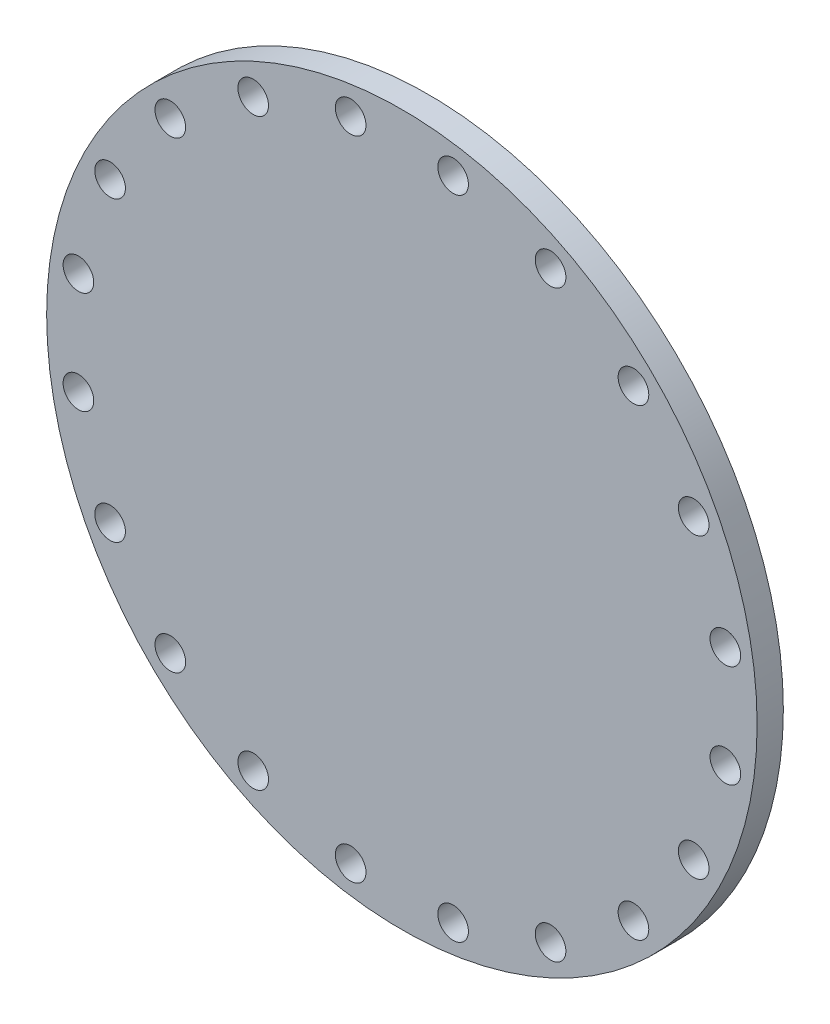
ISO-10303-21;
HEADER;
FILE_DESCRIPTION(('STEP AP214'),'2;1');
FILE_NAME('part.step','',(''),(''),'','','');
FILE_SCHEMA(('AUTOMOTIVE_DESIGN { 1 0 10303 214 1 1 1 1 }'));
ENDSEC;
DATA;
#1=APPLICATION_CONTEXT('core data for automotive mechanical design processes');
#2=APPLICATION_PROTOCOL_DEFINITION('international standard','automotive_design',2000,#1);
#3=PRODUCT_CONTEXT('',#1,'mechanical');
#4=PRODUCT('Part','Part','',(#3));
#5=PRODUCT_RELATED_PRODUCT_CATEGORY('part','',(#4));
#6=PRODUCT_DEFINITION_FORMATION('','',#4);
#7=PRODUCT_DEFINITION_CONTEXT('part definition',#1,'design');
#8=PRODUCT_DEFINITION('design','',#6,#7);
#9=PRODUCT_DEFINITION_SHAPE('','',#8);
#10=(LENGTH_UNIT() NAMED_UNIT(*) SI_UNIT(.MILLI.,.METRE.));
#11=(NAMED_UNIT(*) PLANE_ANGLE_UNIT() SI_UNIT($,.RADIAN.));
#12=(NAMED_UNIT(*) SI_UNIT($,.STERADIAN.) SOLID_ANGLE_UNIT());
#13=UNCERTAINTY_MEASURE_WITH_UNIT(LENGTH_MEASURE(1.E-05),#10,'distance_accuracy_value','');
#14=(GEOMETRIC_REPRESENTATION_CONTEXT(3) GLOBAL_UNCERTAINTY_ASSIGNED_CONTEXT((#13)) GLOBAL_UNIT_ASSIGNED_CONTEXT((#10,
#11,#12)) REPRESENTATION_CONTEXT('',''));
#15=CARTESIAN_POINT('',(0.,0.,0.));
#16=DIRECTION('',(0.,0.,1.));
#17=DIRECTION('',(1.,0.,0.));
#18=AXIS2_PLACEMENT_3D('',#15,#16,#17);
#19=CARTESIAN_POINT('',(0.,0.,30.));
#20=DIRECTION('',(0.,0.,-1.));
#21=DIRECTION('',(-1.,0.,0.));
#22=AXIS2_PLACEMENT_3D('',#19,#20,#21);
#23=CYLINDRICAL_SURFACE('',#22,406.4);
#24=CARTESIAN_POINT('',(0.,0.,30.));
#25=DIRECTION('',(0.,0.,1.));
#26=DIRECTION('',(1.,0.,0.));
#27=AXIS2_PLACEMENT_3D('',#24,#25,#26);
#28=CIRCLE('',#27,406.4);
#29=CARTESIAN_POINT('',(406.4,0.,30.));
#30=VERTEX_POINT('',#29);
#31=EDGE_CURVE('E10',#30,#30,#28,.T.);
#32=ORIENTED_EDGE('',*,*,#31,.F.);
#33=EDGE_LOOP('',(#32));
#34=FACE_BOUND('',#33,.T.);
#35=CARTESIAN_POINT('',(0.,0.,0.));
#36=DIRECTION('',(0.,0.,1.));
#37=DIRECTION('',(1.,0.,0.));
#38=AXIS2_PLACEMENT_3D('',#35,#36,#37);
#39=CIRCLE('',#38,406.4);
#40=CARTESIAN_POINT('',(406.4,0.,0.));
#41=VERTEX_POINT('',#40);
#42=EDGE_CURVE('E31',#41,#41,#39,.T.);
#43=ORIENTED_EDGE('',*,*,#42,.T.);
#44=EDGE_LOOP('',(#43));
#45=FACE_BOUND('',#44,.T.);
#46=ADVANCED_FACE('F28',(#34,#45),#23,.T.);
#47=CARTESIAN_POINT('',(0.,0.,30.));
#48=DIRECTION('',(0.,0.,1.));
#49=DIRECTION('',(1.,0.,0.));
#50=AXIS2_PLACEMENT_3D('',#47,#48,#49);
#51=PLANE('',#50);
#52=CARTESIAN_POINT('',(-170.087540727417,333.815594287174,30.));
#53=DIRECTION('',(0.,0.,-1.));
#54=DIRECTION('',(-0.951056516295158,-0.309016994374935,0.));
#55=AXIS2_PLACEMENT_3D('',#52,#53,#54);
#56=CIRCLE('',#55,17.526);
#57=CARTESIAN_POINT('',(-186.755757232006,328.399762443759,30.));
#58=VERTEX_POINT('',#57);
#59=EDGE_CURVE('E151',#58,#58,#56,.T.);
#60=ORIENTED_EDGE('',*,*,#59,.T.);
#61=EDGE_LOOP('',(#60));
#62=FACE_BOUND('',#61,.T.);
#63=CARTESIAN_POINT('',(-264.917555571537,264.917555571543,30.));
#64=DIRECTION('',(0.,0.,-1.));
#65=DIRECTION('',(-0.809016994374955,-0.587785252292462,0.));
#66=AXIS2_PLACEMENT_3D('',#63,#64,#65);
#67=CIRCLE('',#66,17.526);
#68=CARTESIAN_POINT('',(-279.096387414952,254.616031239866,30.));
#69=VERTEX_POINT('',#68);
#70=EDGE_CURVE('E145',#69,#69,#67,.T.);
#71=ORIENTED_EDGE('',*,*,#70,.T.);
#72=EDGE_LOOP('',(#71));
#73=FACE_BOUND('',#72,.T.);
#74=CARTESIAN_POINT('',(-333.81559428717,170.087540727425,30.));
#75=DIRECTION('',(0.,0.,-1.));
#76=DIRECTION('',(-0.587785252292483,-0.80901699437494,0.));
#77=AXIS2_PLACEMENT_3D('',#74,#75,#76);
#78=CIRCLE('',#77,17.526);
#79=CARTESIAN_POINT('',(-344.117118618848,155.90870888401,30.));
#80=VERTEX_POINT('',#79);
#81=EDGE_CURVE('E139',#80,#80,#78,.T.);
#82=ORIENTED_EDGE('',*,*,#81,.T.);
#83=EDGE_LOOP('',(#82));
#84=FACE_BOUND('',#83,.T.);
#85=CARTESIAN_POINT('',(-370.037436803968,58.6081723273265,30.));
#86=DIRECTION('',(0.,0.,-1.));
#87=DIRECTION('',(-0.309016994374958,-0.95105651629515,0.));
#88=AXIS2_PLACEMENT_3D('',#85,#86,#87);
#89=CIRCLE('',#88,17.526);
#90=CARTESIAN_POINT('',(-375.453268647383,41.9399558227377,30.));
#91=VERTEX_POINT('',#90);
#92=EDGE_CURVE('E133',#91,#91,#89,.T.);
#93=ORIENTED_EDGE('',*,*,#92,.T.);
#94=EDGE_LOOP('',(#93));
#95=FACE_BOUND('',#94,.T.);
#96=CARTESIAN_POINT('',(-370.037436803969,-58.6081723273188,30.));
#97=DIRECTION('',(0.,0.,-1.));
#98=DIRECTION('',(0.,-1.,0.));
#99=AXIS2_PLACEMENT_3D('',#96,#97,#98);
#100=CIRCLE('',#99,17.526);
#101=CARTESIAN_POINT('',(-370.037436803969,-76.1341723273188,30.));
#102=VERTEX_POINT('',#101);
#103=EDGE_CURVE('E127',#102,#102,#100,.T.);
#104=ORIENTED_EDGE('',*,*,#103,.T.);
#105=EDGE_LOOP('',(#104));
#106=FACE_BOUND('',#105,.T.);
#107=CARTESIAN_POINT('',(-333.815594287174,-170.087540727418,30.));
#108=DIRECTION('',(0.,0.,-1.));
#109=DIRECTION('',(0.309016994374938,-0.951056516295157,0.));
#110=AXIS2_PLACEMENT_3D('',#107,#108,#109);
#111=CIRCLE('',#110,17.526);
#112=CARTESIAN_POINT('',(-328.399762443758,-186.755757232007,30.));
#113=VERTEX_POINT('',#112);
#114=EDGE_CURVE('E121',#113,#113,#111,.T.);
#115=ORIENTED_EDGE('',*,*,#114,.T.);
#116=EDGE_LOOP('',(#115));
#117=FACE_BOUND('',#116,.T.);
#118=CARTESIAN_POINT('',(-264.917555571542,-264.917555571538,30.));
#119=DIRECTION('',(0.,0.,-1.));
#120=DIRECTION('',(0.587785252292465,-0.809016994374953,0.));
#121=AXIS2_PLACEMENT_3D('',#118,#119,#120);
#122=CIRCLE('',#121,17.526);
#123=CARTESIAN_POINT('',(-254.616031239865,-279.096387414953,30.));
#124=VERTEX_POINT('',#123);
#125=EDGE_CURVE('E115',#124,#124,#122,.T.);
#126=ORIENTED_EDGE('',*,*,#125,.T.);
#127=EDGE_LOOP('',(#126));
#128=FACE_BOUND('',#127,.T.);
#129=CARTESIAN_POINT('',(-170.087540727424,-333.815594287171,30.));
#130=DIRECTION('',(0.,0.,-1.));
#131=DIRECTION('',(0.809016994374942,-0.58778525229248,0.));
#132=AXIS2_PLACEMENT_3D('',#129,#130,#131);
#133=CIRCLE('',#132,17.526);
#134=CARTESIAN_POINT('',(-155.908708884009,-344.117118618849,30.));
#135=VERTEX_POINT('',#134);
#136=EDGE_CURVE('E109',#135,#135,#133,.T.);
#137=ORIENTED_EDGE('',*,*,#136,.T.);
#138=EDGE_LOOP('',(#137));
#139=FACE_BOUND('',#138,.T.);
#140=CARTESIAN_POINT('',(-58.6081723273252,-370.037436803968,30.));
#141=DIRECTION('',(0.,0.,-1.));
#142=DIRECTION('',(0.951056516295151,-0.309016994374955,0.));
#143=AXIS2_PLACEMENT_3D('',#140,#141,#142);
#144=CIRCLE('',#143,17.526);
#145=CARTESIAN_POINT('',(-41.9399558227364,-375.453268647383,30.));
#146=VERTEX_POINT('',#145);
#147=EDGE_CURVE('E103',#146,#146,#144,.T.);
#148=ORIENTED_EDGE('',*,*,#147,.T.);
#149=EDGE_LOOP('',(#148));
#150=FACE_BOUND('',#149,.T.);
#151=CARTESIAN_POINT('',(58.6081723273201,-370.037436803969,30.));
#152=DIRECTION('',(0.,0.,-1.));
#153=DIRECTION('',(1.,0.,0.));
#154=AXIS2_PLACEMENT_3D('',#151,#152,#153);
#155=CIRCLE('',#154,17.526);
#156=CARTESIAN_POINT('',(76.1341723273201,-370.037436803969,30.));
#157=VERTEX_POINT('',#156);
#158=EDGE_CURVE('E97',#157,#157,#155,.T.);
#159=ORIENTED_EDGE('',*,*,#158,.T.);
#160=EDGE_LOOP('',(#159));
#161=FACE_BOUND('',#160,.T.);
#162=CARTESIAN_POINT('',(170.087540727419,-333.815594287173,30.));
#163=DIRECTION('',(0.,0.,-1.));
#164=DIRECTION('',(0.951056516295156,0.309016994374941,0.));
#165=AXIS2_PLACEMENT_3D('',#162,#163,#164);
#166=CIRCLE('',#165,17.526);
#167=CARTESIAN_POINT('',(186.755757232008,-328.399762443758,30.));
#168=VERTEX_POINT('',#167);
#169=EDGE_CURVE('E91',#168,#168,#166,.T.);
#170=ORIENTED_EDGE('',*,*,#169,.T.);
#171=EDGE_LOOP('',(#170));
#172=FACE_BOUND('',#171,.T.);
#173=CARTESIAN_POINT('',(264.917555571539,-264.917555571541,30.));
#174=DIRECTION('',(0.,0.,-1.));
#175=DIRECTION('',(0.809016994374951,0.587785252292469,0.));
#176=AXIS2_PLACEMENT_3D('',#173,#174,#175);
#177=CIRCLE('',#176,17.526);
#178=CARTESIAN_POINT('',(279.096387414954,-254.616031239864,30.));
#179=VERTEX_POINT('',#178);
#180=EDGE_CURVE('E85',#179,#179,#177,.T.);
#181=ORIENTED_EDGE('',*,*,#180,.T.);
#182=EDGE_LOOP('',(#181));
#183=FACE_BOUND('',#182,.T.);
#184=CARTESIAN_POINT('',(333.815594287171,-170.087540727423,30.));
#185=DIRECTION('',(0.,0.,-1.));
#186=DIRECTION('',(0.587785252292477,0.809016994374945,0.));
#187=AXIS2_PLACEMENT_3D('',#184,#185,#186);
#188=CIRCLE('',#187,17.526);
#189=CARTESIAN_POINT('',(344.117118618849,-155.908708884007,30.));
#190=VERTEX_POINT('',#189);
#191=EDGE_CURVE('E79',#190,#190,#188,.T.);
#192=ORIENTED_EDGE('',*,*,#191,.T.);
#193=EDGE_LOOP('',(#192));
#194=FACE_BOUND('',#193,.T.);
#195=CARTESIAN_POINT('',(370.037436803968,-58.6081723273239,30.));
#196=DIRECTION('',(0.,0.,-1.));
#197=DIRECTION('',(0.309016994374952,0.951056516295152,0.));
#198=AXIS2_PLACEMENT_3D('',#195,#196,#197);
#199=CIRCLE('',#198,17.526);
#200=CARTESIAN_POINT('',(375.453268647384,-41.9399558227351,30.));
#201=VERTEX_POINT('',#200);
#202=EDGE_CURVE('E73',#201,#201,#199,.T.);
#203=ORIENTED_EDGE('',*,*,#202,.T.);
#204=EDGE_LOOP('',(#203));
#205=FACE_BOUND('',#204,.T.);
#206=CARTESIAN_POINT('',(370.037436803969,58.6081723273214,30.));
#207=DIRECTION('',(0.,0.,-1.));
#208=DIRECTION('',(0.,1.,0.));
#209=AXIS2_PLACEMENT_3D('',#206,#207,#208);
#210=CIRCLE('',#209,17.526);
#211=CARTESIAN_POINT('',(370.037436803969,76.1341723273214,30.));
#212=VERTEX_POINT('',#211);
#213=EDGE_CURVE('E67',#212,#212,#210,.T.);
#214=ORIENTED_EDGE('',*,*,#213,.T.);
#215=EDGE_LOOP('',(#214));
#216=FACE_BOUND('',#215,.T.);
#217=CARTESIAN_POINT('',(333.815594287173,170.087540727421,30.));
#218=DIRECTION('',(0.,0.,-1.));
#219=DIRECTION('',(-0.309016994374945,0.951056516295155,0.));
#220=AXIS2_PLACEMENT_3D('',#217,#218,#219);
#221=CIRCLE('',#220,17.526);
#222=CARTESIAN_POINT('',(328.399762443757,186.755757232009,30.));
#223=VERTEX_POINT('',#222);
#224=EDGE_CURVE('E61',#223,#223,#221,.T.);
#225=ORIENTED_EDGE('',*,*,#224,.T.);
#226=EDGE_LOOP('',(#225));
#227=FACE_BOUND('',#226,.T.);
#228=CARTESIAN_POINT('',(264.917555571541,264.91755557154,30.));
#229=DIRECTION('',(0.,0.,-1.));
#230=DIRECTION('',(-0.587785252292471,0.809016994374949,0.));
#231=AXIS2_PLACEMENT_3D('',#228,#229,#230);
#232=CIRCLE('',#231,17.526);
#233=CARTESIAN_POINT('',(254.616031239863,279.096387414955,30.));
#234=VERTEX_POINT('',#233);
#235=EDGE_CURVE('E55',#234,#234,#232,.T.);
#236=ORIENTED_EDGE('',*,*,#235,.T.);
#237=EDGE_LOOP('',(#236));
#238=FACE_BOUND('',#237,.T.);
#239=CARTESIAN_POINT('',(170.087540727422,333.815594287172,30.));
#240=DIRECTION('',(0.,0.,-1.));
#241=DIRECTION('',(-0.809016994374947,0.587785252292474,0.));
#242=AXIS2_PLACEMENT_3D('',#239,#240,#241);
#243=CIRCLE('',#242,17.526);
#244=CARTESIAN_POINT('',(155.908708884006,344.11711861885,30.));
#245=VERTEX_POINT('',#244);
#246=EDGE_CURVE('E49',#245,#245,#243,.T.);
#247=ORIENTED_EDGE('',*,*,#246,.T.);
#248=EDGE_LOOP('',(#247));
#249=FACE_BOUND('',#248,.T.);
#250=CARTESIAN_POINT('',(58.6081723273226,370.037436803968,30.));
#251=DIRECTION('',(0.,0.,-1.));
#252=DIRECTION('',(-0.951056516295154,0.309016994374948,0.));
#253=AXIS2_PLACEMENT_3D('',#250,#251,#252);
#254=CIRCLE('',#253,17.526);
#255=CARTESIAN_POINT('',(41.9399558227338,375.453268647384,30.));
#256=VERTEX_POINT('',#255);
#257=EDGE_CURVE('E43',#256,#256,#254,.T.);
#258=ORIENTED_EDGE('',*,*,#257,.T.);
#259=EDGE_LOOP('',(#258));
#260=FACE_BOUND('',#259,.T.);
#261=CARTESIAN_POINT('',(-58.6081723273227,370.037436803968,30.));
#262=DIRECTION('',(0.,0.,-1.));
#263=DIRECTION('',(-1.,0.,0.));
#264=AXIS2_PLACEMENT_3D('',#261,#262,#263);
#265=CIRCLE('',#264,17.526);
#266=CARTESIAN_POINT('',(-76.1341723273227,370.037436803968,30.));
#267=VERTEX_POINT('',#266);
#268=EDGE_CURVE('E38',#267,#267,#265,.T.);
#269=ORIENTED_EDGE('',*,*,#268,.T.);
#270=EDGE_LOOP('',(#269));
#271=FACE_BOUND('',#270,.T.);
#272=ORIENTED_EDGE('',*,*,#31,.T.);
#273=EDGE_LOOP('',(#272));
#274=FACE_BOUND('',#273,.T.);
#275=ADVANCED_FACE('F160',(#62,#73,#84,#95,#106,#117,#128,#139,#150,#161,#172,#183,#194,#205,
#216,#227,#238,#249,#260,#271,#274),#51,.T.);
#276=CARTESIAN_POINT('',(0.,0.,0.));
#277=DIRECTION('',(0.,0.,1.));
#278=DIRECTION('',(1.,0.,0.));
#279=AXIS2_PLACEMENT_3D('',#276,#277,#278);
#280=PLANE('',#279);
#281=CARTESIAN_POINT('',(-170.087540727417,333.815594287174,0.));
#282=DIRECTION('',(0.,0.,-1.));
#283=DIRECTION('',(-0.951056516295158,-0.309016994374935,0.));
#284=AXIS2_PLACEMENT_3D('',#281,#282,#283);
#285=CIRCLE('',#284,17.526);
#286=CARTESIAN_POINT('',(-186.755757232006,328.399762443759,0.));
#287=VERTEX_POINT('',#286);
#288=EDGE_CURVE('E154',#287,#287,#285,.T.);
#289=ORIENTED_EDGE('',*,*,#288,.F.);
#290=EDGE_LOOP('',(#289));
#291=FACE_BOUND('',#290,.T.);
#292=CARTESIAN_POINT('',(-264.917555571537,264.917555571543,0.));
#293=DIRECTION('',(0.,0.,-1.));
#294=DIRECTION('',(-0.809016994374955,-0.587785252292462,0.));
#295=AXIS2_PLACEMENT_3D('',#292,#293,#294);
#296=CIRCLE('',#295,17.526);
#297=CARTESIAN_POINT('',(-279.096387414952,254.616031239866,0.));
#298=VERTEX_POINT('',#297);
#299=EDGE_CURVE('E148',#298,#298,#296,.T.);
#300=ORIENTED_EDGE('',*,*,#299,.F.);
#301=EDGE_LOOP('',(#300));
#302=FACE_BOUND('',#301,.T.);
#303=CARTESIAN_POINT('',(-333.81559428717,170.087540727425,0.));
#304=DIRECTION('',(0.,0.,-1.));
#305=DIRECTION('',(-0.587785252292483,-0.80901699437494,0.));
#306=AXIS2_PLACEMENT_3D('',#303,#304,#305);
#307=CIRCLE('',#306,17.526);
#308=CARTESIAN_POINT('',(-344.117118618848,155.90870888401,0.));
#309=VERTEX_POINT('',#308);
#310=EDGE_CURVE('E142',#309,#309,#307,.T.);
#311=ORIENTED_EDGE('',*,*,#310,.F.);
#312=EDGE_LOOP('',(#311));
#313=FACE_BOUND('',#312,.T.);
#314=CARTESIAN_POINT('',(-370.037436803968,58.6081723273265,0.));
#315=DIRECTION('',(0.,0.,-1.));
#316=DIRECTION('',(-0.309016994374958,-0.95105651629515,0.));
#317=AXIS2_PLACEMENT_3D('',#314,#315,#316);
#318=CIRCLE('',#317,17.526);
#319=CARTESIAN_POINT('',(-375.453268647383,41.9399558227377,0.));
#320=VERTEX_POINT('',#319);
#321=EDGE_CURVE('E136',#320,#320,#318,.T.);
#322=ORIENTED_EDGE('',*,*,#321,.F.);
#323=EDGE_LOOP('',(#322));
#324=FACE_BOUND('',#323,.T.);
#325=CARTESIAN_POINT('',(-370.037436803969,-58.6081723273188,0.));
#326=DIRECTION('',(0.,0.,-1.));
#327=DIRECTION('',(0.,-1.,0.));
#328=AXIS2_PLACEMENT_3D('',#325,#326,#327);
#329=CIRCLE('',#328,17.526);
#330=CARTESIAN_POINT('',(-370.037436803969,-76.1341723273188,0.));
#331=VERTEX_POINT('',#330);
#332=EDGE_CURVE('E130',#331,#331,#329,.T.);
#333=ORIENTED_EDGE('',*,*,#332,.F.);
#334=EDGE_LOOP('',(#333));
#335=FACE_BOUND('',#334,.T.);
#336=CARTESIAN_POINT('',(-333.815594287174,-170.087540727418,0.));
#337=DIRECTION('',(0.,0.,-1.));
#338=DIRECTION('',(0.309016994374938,-0.951056516295157,0.));
#339=AXIS2_PLACEMENT_3D('',#336,#337,#338);
#340=CIRCLE('',#339,17.526);
#341=CARTESIAN_POINT('',(-328.399762443758,-186.755757232007,0.));
#342=VERTEX_POINT('',#341);
#343=EDGE_CURVE('E124',#342,#342,#340,.T.);
#344=ORIENTED_EDGE('',*,*,#343,.F.);
#345=EDGE_LOOP('',(#344));
#346=FACE_BOUND('',#345,.T.);
#347=CARTESIAN_POINT('',(-264.917555571542,-264.917555571538,0.));
#348=DIRECTION('',(0.,0.,-1.));
#349=DIRECTION('',(0.587785252292465,-0.809016994374953,0.));
#350=AXIS2_PLACEMENT_3D('',#347,#348,#349);
#351=CIRCLE('',#350,17.526);
#352=CARTESIAN_POINT('',(-254.616031239865,-279.096387414953,0.));
#353=VERTEX_POINT('',#352);
#354=EDGE_CURVE('E118',#353,#353,#351,.T.);
#355=ORIENTED_EDGE('',*,*,#354,.F.);
#356=EDGE_LOOP('',(#355));
#357=FACE_BOUND('',#356,.T.);
#358=CARTESIAN_POINT('',(-170.087540727424,-333.815594287171,0.));
#359=DIRECTION('',(0.,0.,-1.));
#360=DIRECTION('',(0.809016994374942,-0.58778525229248,0.));
#361=AXIS2_PLACEMENT_3D('',#358,#359,#360);
#362=CIRCLE('',#361,17.526);
#363=CARTESIAN_POINT('',(-155.908708884009,-344.117118618849,0.));
#364=VERTEX_POINT('',#363);
#365=EDGE_CURVE('E112',#364,#364,#362,.T.);
#366=ORIENTED_EDGE('',*,*,#365,.F.);
#367=EDGE_LOOP('',(#366));
#368=FACE_BOUND('',#367,.T.);
#369=CARTESIAN_POINT('',(-58.6081723273252,-370.037436803968,0.));
#370=DIRECTION('',(0.,0.,-1.));
#371=DIRECTION('',(0.951056516295151,-0.309016994374955,0.));
#372=AXIS2_PLACEMENT_3D('',#369,#370,#371);
#373=CIRCLE('',#372,17.526);
#374=CARTESIAN_POINT('',(-41.9399558227364,-375.453268647383,0.));
#375=VERTEX_POINT('',#374);
#376=EDGE_CURVE('E106',#375,#375,#373,.T.);
#377=ORIENTED_EDGE('',*,*,#376,.F.);
#378=EDGE_LOOP('',(#377));
#379=FACE_BOUND('',#378,.T.);
#380=CARTESIAN_POINT('',(58.6081723273201,-370.037436803969,0.));
#381=DIRECTION('',(0.,0.,-1.));
#382=DIRECTION('',(1.,0.,0.));
#383=AXIS2_PLACEMENT_3D('',#380,#381,#382);
#384=CIRCLE('',#383,17.526);
#385=CARTESIAN_POINT('',(76.1341723273201,-370.037436803969,0.));
#386=VERTEX_POINT('',#385);
#387=EDGE_CURVE('E100',#386,#386,#384,.T.);
#388=ORIENTED_EDGE('',*,*,#387,.F.);
#389=EDGE_LOOP('',(#388));
#390=FACE_BOUND('',#389,.T.);
#391=CARTESIAN_POINT('',(170.087540727419,-333.815594287173,0.));
#392=DIRECTION('',(0.,0.,-1.));
#393=DIRECTION('',(0.951056516295156,0.309016994374941,0.));
#394=AXIS2_PLACEMENT_3D('',#391,#392,#393);
#395=CIRCLE('',#394,17.526);
#396=CARTESIAN_POINT('',(186.755757232008,-328.399762443758,0.));
#397=VERTEX_POINT('',#396);
#398=EDGE_CURVE('E94',#397,#397,#395,.T.);
#399=ORIENTED_EDGE('',*,*,#398,.F.);
#400=EDGE_LOOP('',(#399));
#401=FACE_BOUND('',#400,.T.);
#402=CARTESIAN_POINT('',(264.917555571539,-264.917555571541,0.));
#403=DIRECTION('',(0.,0.,-1.));
#404=DIRECTION('',(0.809016994374951,0.587785252292469,0.));
#405=AXIS2_PLACEMENT_3D('',#402,#403,#404);
#406=CIRCLE('',#405,17.526);
#407=CARTESIAN_POINT('',(279.096387414954,-254.616031239864,0.));
#408=VERTEX_POINT('',#407);
#409=EDGE_CURVE('E88',#408,#408,#406,.T.);
#410=ORIENTED_EDGE('',*,*,#409,.F.);
#411=EDGE_LOOP('',(#410));
#412=FACE_BOUND('',#411,.T.);
#413=CARTESIAN_POINT('',(333.815594287171,-170.087540727423,0.));
#414=DIRECTION('',(0.,0.,-1.));
#415=DIRECTION('',(0.587785252292477,0.809016994374945,0.));
#416=AXIS2_PLACEMENT_3D('',#413,#414,#415);
#417=CIRCLE('',#416,17.526);
#418=CARTESIAN_POINT('',(344.117118618849,-155.908708884007,0.));
#419=VERTEX_POINT('',#418);
#420=EDGE_CURVE('E82',#419,#419,#417,.T.);
#421=ORIENTED_EDGE('',*,*,#420,.F.);
#422=EDGE_LOOP('',(#421));
#423=FACE_BOUND('',#422,.T.);
#424=CARTESIAN_POINT('',(370.037436803968,-58.6081723273239,0.));
#425=DIRECTION('',(0.,0.,-1.));
#426=DIRECTION('',(0.309016994374952,0.951056516295152,0.));
#427=AXIS2_PLACEMENT_3D('',#424,#425,#426);
#428=CIRCLE('',#427,17.526);
#429=CARTESIAN_POINT('',(375.453268647384,-41.9399558227351,0.));
#430=VERTEX_POINT('',#429);
#431=EDGE_CURVE('E76',#430,#430,#428,.T.);
#432=ORIENTED_EDGE('',*,*,#431,.F.);
#433=EDGE_LOOP('',(#432));
#434=FACE_BOUND('',#433,.T.);
#435=CARTESIAN_POINT('',(370.037436803969,58.6081723273214,0.));
#436=DIRECTION('',(0.,0.,-1.));
#437=DIRECTION('',(0.,1.,0.));
#438=AXIS2_PLACEMENT_3D('',#435,#436,#437);
#439=CIRCLE('',#438,17.526);
#440=CARTESIAN_POINT('',(370.037436803969,76.1341723273214,0.));
#441=VERTEX_POINT('',#440);
#442=EDGE_CURVE('E70',#441,#441,#439,.T.);
#443=ORIENTED_EDGE('',*,*,#442,.F.);
#444=EDGE_LOOP('',(#443));
#445=FACE_BOUND('',#444,.T.);
#446=CARTESIAN_POINT('',(333.815594287173,170.087540727421,0.));
#447=DIRECTION('',(0.,0.,-1.));
#448=DIRECTION('',(-0.309016994374945,0.951056516295155,0.));
#449=AXIS2_PLACEMENT_3D('',#446,#447,#448);
#450=CIRCLE('',#449,17.526);
#451=CARTESIAN_POINT('',(328.399762443757,186.755757232009,0.));
#452=VERTEX_POINT('',#451);
#453=EDGE_CURVE('E64',#452,#452,#450,.T.);
#454=ORIENTED_EDGE('',*,*,#453,.F.);
#455=EDGE_LOOP('',(#454));
#456=FACE_BOUND('',#455,.T.);
#457=CARTESIAN_POINT('',(264.917555571541,264.91755557154,0.));
#458=DIRECTION('',(0.,0.,-1.));
#459=DIRECTION('',(-0.587785252292471,0.809016994374949,0.));
#460=AXIS2_PLACEMENT_3D('',#457,#458,#459);
#461=CIRCLE('',#460,17.526);
#462=CARTESIAN_POINT('',(254.616031239863,279.096387414955,0.));
#463=VERTEX_POINT('',#462);
#464=EDGE_CURVE('E58',#463,#463,#461,.T.);
#465=ORIENTED_EDGE('',*,*,#464,.F.);
#466=EDGE_LOOP('',(#465));
#467=FACE_BOUND('',#466,.T.);
#468=CARTESIAN_POINT('',(170.087540727422,333.815594287172,0.));
#469=DIRECTION('',(0.,0.,-1.));
#470=DIRECTION('',(-0.809016994374947,0.587785252292474,0.));
#471=AXIS2_PLACEMENT_3D('',#468,#469,#470);
#472=CIRCLE('',#471,17.526);
#473=CARTESIAN_POINT('',(155.908708884006,344.11711861885,0.));
#474=VERTEX_POINT('',#473);
#475=EDGE_CURVE('E52',#474,#474,#472,.T.);
#476=ORIENTED_EDGE('',*,*,#475,.F.);
#477=EDGE_LOOP('',(#476));
#478=FACE_BOUND('',#477,.T.);
#479=CARTESIAN_POINT('',(58.6081723273226,370.037436803968,0.));
#480=DIRECTION('',(0.,0.,-1.));
#481=DIRECTION('',(-0.951056516295154,0.309016994374948,0.));
#482=AXIS2_PLACEMENT_3D('',#479,#480,#481);
#483=CIRCLE('',#482,17.526);
#484=CARTESIAN_POINT('',(41.9399558227338,375.453268647384,0.));
#485=VERTEX_POINT('',#484);
#486=EDGE_CURVE('E46',#485,#485,#483,.T.);
#487=ORIENTED_EDGE('',*,*,#486,.F.);
#488=EDGE_LOOP('',(#487));
#489=FACE_BOUND('',#488,.T.);
#490=CARTESIAN_POINT('',(-58.6081723273227,370.037436803968,0.));
#491=DIRECTION('',(0.,0.,-1.));
#492=DIRECTION('',(-1.,0.,0.));
#493=AXIS2_PLACEMENT_3D('',#490,#491,#492);
#494=CIRCLE('',#493,17.526);
#495=CARTESIAN_POINT('',(-76.1341723273227,370.037436803968,0.));
#496=VERTEX_POINT('',#495);
#497=EDGE_CURVE('E40',#496,#496,#494,.T.);
#498=ORIENTED_EDGE('',*,*,#497,.F.);
#499=EDGE_LOOP('',(#498));
#500=FACE_BOUND('',#499,.T.);
#501=ORIENTED_EDGE('',*,*,#42,.F.);
#502=EDGE_LOOP('',(#501));
#503=FACE_BOUND('',#502,.T.);
#504=ADVANCED_FACE('F170',(#291,#302,#313,#324,#335,#346,#357,#368,#379,#390,#401,#412,#423,
#434,#445,#456,#467,#478,#489,#500,#503),#280,.F.);
#505=CARTESIAN_POINT('',(-58.6081723273227,370.037436803968,30.));
#506=DIRECTION('',(0.,0.,-1.));
#507=DIRECTION('',(-1.,0.,0.));
#508=AXIS2_PLACEMENT_3D('',#505,#506,#507);
#509=CYLINDRICAL_SURFACE('',#508,17.526);
#510=ORIENTED_EDGE('',*,*,#268,.F.);
#511=EDGE_LOOP('',(#510));
#512=FACE_BOUND('',#511,.T.);
#513=ORIENTED_EDGE('',*,*,#497,.T.);
#514=EDGE_LOOP('',(#513));
#515=FACE_BOUND('',#514,.T.);
#516=ADVANCED_FACE('F173',(#512,#515),#509,.F.);
#517=CARTESIAN_POINT('',(58.6081723273226,370.037436803968,30.));
#518=DIRECTION('',(0.,0.,-1.));
#519=DIRECTION('',(-1.,0.,0.));
#520=AXIS2_PLACEMENT_3D('',#517,#518,#519);
#521=CYLINDRICAL_SURFACE('',#520,17.526);
#522=ORIENTED_EDGE('',*,*,#257,.F.);
#523=EDGE_LOOP('',(#522));
#524=FACE_BOUND('',#523,.T.);
#525=ORIENTED_EDGE('',*,*,#486,.T.);
#526=EDGE_LOOP('',(#525));
#527=FACE_BOUND('',#526,.T.);
#528=ADVANCED_FACE('F225',(#524,#527),#521,.F.);
#529=CARTESIAN_POINT('',(170.087540727422,333.815594287172,30.));
#530=DIRECTION('',(0.,0.,-1.));
#531=DIRECTION('',(-1.,0.,0.));
#532=AXIS2_PLACEMENT_3D('',#529,#530,#531);
#533=CYLINDRICAL_SURFACE('',#532,17.526);
#534=ORIENTED_EDGE('',*,*,#246,.F.);
#535=EDGE_LOOP('',(#534));
#536=FACE_BOUND('',#535,.T.);
#537=ORIENTED_EDGE('',*,*,#475,.T.);
#538=EDGE_LOOP('',(#537));
#539=FACE_BOUND('',#538,.T.);
#540=ADVANCED_FACE('F229',(#536,#539),#533,.F.);
#541=CARTESIAN_POINT('',(264.917555571541,264.91755557154,30.));
#542=DIRECTION('',(0.,0.,-1.));
#543=DIRECTION('',(-1.,0.,0.));
#544=AXIS2_PLACEMENT_3D('',#541,#542,#543);
#545=CYLINDRICAL_SURFACE('',#544,17.526);
#546=ORIENTED_EDGE('',*,*,#235,.F.);
#547=EDGE_LOOP('',(#546));
#548=FACE_BOUND('',#547,.T.);
#549=ORIENTED_EDGE('',*,*,#464,.T.);
#550=EDGE_LOOP('',(#549));
#551=FACE_BOUND('',#550,.T.);
#552=ADVANCED_FACE('F233',(#548,#551),#545,.F.);
#553=CARTESIAN_POINT('',(333.815594287173,170.087540727421,30.));
#554=DIRECTION('',(0.,0.,-1.));
#555=DIRECTION('',(-1.,0.,0.));
#556=AXIS2_PLACEMENT_3D('',#553,#554,#555);
#557=CYLINDRICAL_SURFACE('',#556,17.526);
#558=ORIENTED_EDGE('',*,*,#224,.F.);
#559=EDGE_LOOP('',(#558));
#560=FACE_BOUND('',#559,.T.);
#561=ORIENTED_EDGE('',*,*,#453,.T.);
#562=EDGE_LOOP('',(#561));
#563=FACE_BOUND('',#562,.T.);
#564=ADVANCED_FACE('F237',(#560,#563),#557,.F.);
#565=CARTESIAN_POINT('',(370.037436803969,58.6081723273214,30.));
#566=DIRECTION('',(0.,0.,-1.));
#567=DIRECTION('',(-1.,0.,0.));
#568=AXIS2_PLACEMENT_3D('',#565,#566,#567);
#569=CYLINDRICAL_SURFACE('',#568,17.526);
#570=ORIENTED_EDGE('',*,*,#213,.F.);
#571=EDGE_LOOP('',(#570));
#572=FACE_BOUND('',#571,.T.);
#573=ORIENTED_EDGE('',*,*,#442,.T.);
#574=EDGE_LOOP('',(#573));
#575=FACE_BOUND('',#574,.T.);
#576=ADVANCED_FACE('F241',(#572,#575),#569,.F.);
#577=CARTESIAN_POINT('',(370.037436803968,-58.6081723273239,30.));
#578=DIRECTION('',(0.,0.,-1.));
#579=DIRECTION('',(-1.,0.,0.));
#580=AXIS2_PLACEMENT_3D('',#577,#578,#579);
#581=CYLINDRICAL_SURFACE('',#580,17.526);
#582=ORIENTED_EDGE('',*,*,#202,.F.);
#583=EDGE_LOOP('',(#582));
#584=FACE_BOUND('',#583,.T.);
#585=ORIENTED_EDGE('',*,*,#431,.T.);
#586=EDGE_LOOP('',(#585));
#587=FACE_BOUND('',#586,.T.);
#588=ADVANCED_FACE('F245',(#584,#587),#581,.F.);
#589=CARTESIAN_POINT('',(333.815594287171,-170.087540727423,30.));
#590=DIRECTION('',(0.,0.,-1.));
#591=DIRECTION('',(-1.,0.,0.));
#592=AXIS2_PLACEMENT_3D('',#589,#590,#591);
#593=CYLINDRICAL_SURFACE('',#592,17.526);
#594=ORIENTED_EDGE('',*,*,#191,.F.);
#595=EDGE_LOOP('',(#594));
#596=FACE_BOUND('',#595,.T.);
#597=ORIENTED_EDGE('',*,*,#420,.T.);
#598=EDGE_LOOP('',(#597));
#599=FACE_BOUND('',#598,.T.);
#600=ADVANCED_FACE('F249',(#596,#599),#593,.F.);
#601=CARTESIAN_POINT('',(264.917555571539,-264.917555571541,30.));
#602=DIRECTION('',(0.,0.,-1.));
#603=DIRECTION('',(-1.,0.,0.));
#604=AXIS2_PLACEMENT_3D('',#601,#602,#603);
#605=CYLINDRICAL_SURFACE('',#604,17.526);
#606=ORIENTED_EDGE('',*,*,#180,.F.);
#607=EDGE_LOOP('',(#606));
#608=FACE_BOUND('',#607,.T.);
#609=ORIENTED_EDGE('',*,*,#409,.T.);
#610=EDGE_LOOP('',(#609));
#611=FACE_BOUND('',#610,.T.);
#612=ADVANCED_FACE('F253',(#608,#611),#605,.F.);
#613=CARTESIAN_POINT('',(170.087540727419,-333.815594287173,30.));
#614=DIRECTION('',(0.,0.,-1.));
#615=DIRECTION('',(-1.,0.,0.));
#616=AXIS2_PLACEMENT_3D('',#613,#614,#615);
#617=CYLINDRICAL_SURFACE('',#616,17.526);
#618=ORIENTED_EDGE('',*,*,#169,.F.);
#619=EDGE_LOOP('',(#618));
#620=FACE_BOUND('',#619,.T.);
#621=ORIENTED_EDGE('',*,*,#398,.T.);
#622=EDGE_LOOP('',(#621));
#623=FACE_BOUND('',#622,.T.);
#624=ADVANCED_FACE('F257',(#620,#623),#617,.F.);
#625=CARTESIAN_POINT('',(58.6081723273201,-370.037436803969,30.));
#626=DIRECTION('',(0.,0.,-1.));
#627=DIRECTION('',(-1.,0.,0.));
#628=AXIS2_PLACEMENT_3D('',#625,#626,#627);
#629=CYLINDRICAL_SURFACE('',#628,17.526);
#630=ORIENTED_EDGE('',*,*,#158,.F.);
#631=EDGE_LOOP('',(#630));
#632=FACE_BOUND('',#631,.T.);
#633=ORIENTED_EDGE('',*,*,#387,.T.);
#634=EDGE_LOOP('',(#633));
#635=FACE_BOUND('',#634,.T.);
#636=ADVANCED_FACE('F261',(#632,#635),#629,.F.);
#637=CARTESIAN_POINT('',(-58.6081723273252,-370.037436803968,30.));
#638=DIRECTION('',(0.,0.,-1.));
#639=DIRECTION('',(-1.,0.,0.));
#640=AXIS2_PLACEMENT_3D('',#637,#638,#639);
#641=CYLINDRICAL_SURFACE('',#640,17.526);
#642=ORIENTED_EDGE('',*,*,#147,.F.);
#643=EDGE_LOOP('',(#642));
#644=FACE_BOUND('',#643,.T.);
#645=ORIENTED_EDGE('',*,*,#376,.T.);
#646=EDGE_LOOP('',(#645));
#647=FACE_BOUND('',#646,.T.);
#648=ADVANCED_FACE('F265',(#644,#647),#641,.F.);
#649=CARTESIAN_POINT('',(-170.087540727424,-333.815594287171,30.));
#650=DIRECTION('',(0.,0.,-1.));
#651=DIRECTION('',(-1.,0.,0.));
#652=AXIS2_PLACEMENT_3D('',#649,#650,#651);
#653=CYLINDRICAL_SURFACE('',#652,17.526);
#654=ORIENTED_EDGE('',*,*,#136,.F.);
#655=EDGE_LOOP('',(#654));
#656=FACE_BOUND('',#655,.T.);
#657=ORIENTED_EDGE('',*,*,#365,.T.);
#658=EDGE_LOOP('',(#657));
#659=FACE_BOUND('',#658,.T.);
#660=ADVANCED_FACE('F269',(#656,#659),#653,.F.);
#661=CARTESIAN_POINT('',(-264.917555571542,-264.917555571538,30.));
#662=DIRECTION('',(0.,0.,-1.));
#663=DIRECTION('',(-1.,0.,0.));
#664=AXIS2_PLACEMENT_3D('',#661,#662,#663);
#665=CYLINDRICAL_SURFACE('',#664,17.526);
#666=ORIENTED_EDGE('',*,*,#125,.F.);
#667=EDGE_LOOP('',(#666));
#668=FACE_BOUND('',#667,.T.);
#669=ORIENTED_EDGE('',*,*,#354,.T.);
#670=EDGE_LOOP('',(#669));
#671=FACE_BOUND('',#670,.T.);
#672=ADVANCED_FACE('F273',(#668,#671),#665,.F.);
#673=CARTESIAN_POINT('',(-333.815594287174,-170.087540727418,30.));
#674=DIRECTION('',(0.,0.,-1.));
#675=DIRECTION('',(-1.,0.,0.));
#676=AXIS2_PLACEMENT_3D('',#673,#674,#675);
#677=CYLINDRICAL_SURFACE('',#676,17.526);
#678=ORIENTED_EDGE('',*,*,#114,.F.);
#679=EDGE_LOOP('',(#678));
#680=FACE_BOUND('',#679,.T.);
#681=ORIENTED_EDGE('',*,*,#343,.T.);
#682=EDGE_LOOP('',(#681));
#683=FACE_BOUND('',#682,.T.);
#684=ADVANCED_FACE('F277',(#680,#683),#677,.F.);
#685=CARTESIAN_POINT('',(-370.037436803969,-58.6081723273188,30.));
#686=DIRECTION('',(0.,0.,-1.));
#687=DIRECTION('',(-1.,0.,0.));
#688=AXIS2_PLACEMENT_3D('',#685,#686,#687);
#689=CYLINDRICAL_SURFACE('',#688,17.526);
#690=ORIENTED_EDGE('',*,*,#103,.F.);
#691=EDGE_LOOP('',(#690));
#692=FACE_BOUND('',#691,.T.);
#693=ORIENTED_EDGE('',*,*,#332,.T.);
#694=EDGE_LOOP('',(#693));
#695=FACE_BOUND('',#694,.T.);
#696=ADVANCED_FACE('F281',(#692,#695),#689,.F.);
#697=CARTESIAN_POINT('',(-370.037436803968,58.6081723273265,30.));
#698=DIRECTION('',(0.,0.,-1.));
#699=DIRECTION('',(-1.,0.,0.));
#700=AXIS2_PLACEMENT_3D('',#697,#698,#699);
#701=CYLINDRICAL_SURFACE('',#700,17.526);
#702=ORIENTED_EDGE('',*,*,#92,.F.);
#703=EDGE_LOOP('',(#702));
#704=FACE_BOUND('',#703,.T.);
#705=ORIENTED_EDGE('',*,*,#321,.T.);
#706=EDGE_LOOP('',(#705));
#707=FACE_BOUND('',#706,.T.);
#708=ADVANCED_FACE('F285',(#704,#707),#701,.F.);
#709=CARTESIAN_POINT('',(-333.81559428717,170.087540727425,30.));
#710=DIRECTION('',(0.,0.,-1.));
#711=DIRECTION('',(-1.,0.,0.));
#712=AXIS2_PLACEMENT_3D('',#709,#710,#711);
#713=CYLINDRICAL_SURFACE('',#712,17.526);
#714=ORIENTED_EDGE('',*,*,#81,.F.);
#715=EDGE_LOOP('',(#714));
#716=FACE_BOUND('',#715,.T.);
#717=ORIENTED_EDGE('',*,*,#310,.T.);
#718=EDGE_LOOP('',(#717));
#719=FACE_BOUND('',#718,.T.);
#720=ADVANCED_FACE('F289',(#716,#719),#713,.F.);
#721=CARTESIAN_POINT('',(-264.917555571537,264.917555571543,30.));
#722=DIRECTION('',(0.,0.,-1.));
#723=DIRECTION('',(-1.,0.,0.));
#724=AXIS2_PLACEMENT_3D('',#721,#722,#723);
#725=CYLINDRICAL_SURFACE('',#724,17.526);
#726=ORIENTED_EDGE('',*,*,#70,.F.);
#727=EDGE_LOOP('',(#726));
#728=FACE_BOUND('',#727,.T.);
#729=ORIENTED_EDGE('',*,*,#299,.T.);
#730=EDGE_LOOP('',(#729));
#731=FACE_BOUND('',#730,.T.);
#732=ADVANCED_FACE('F166',(#728,#731),#725,.F.);
#733=CARTESIAN_POINT('',(-170.087540727417,333.815594287174,30.));
#734=DIRECTION('',(0.,0.,-1.));
#735=DIRECTION('',(-1.,0.,0.));
#736=AXIS2_PLACEMENT_3D('',#733,#734,#735);
#737=CYLINDRICAL_SURFACE('',#736,17.526);
#738=ORIENTED_EDGE('',*,*,#59,.F.);
#739=EDGE_LOOP('',(#738));
#740=FACE_BOUND('',#739,.T.);
#741=ORIENTED_EDGE('',*,*,#288,.T.);
#742=EDGE_LOOP('',(#741));
#743=FACE_BOUND('',#742,.T.);
#744=ADVANCED_FACE('F163',(#740,#743),#737,.F.);
#745=CLOSED_SHELL('',(#46,#275,#504,#516,#528,#540,#552,#564,#576,#588,#600,#612,#624,#636,#648,
#660,#672,#684,#696,#708,#720,#732,#744));
#746=MANIFOLD_SOLID_BREP('B2',#745);
#747=ADVANCED_BREP_SHAPE_REPRESENTATION('',(#18,#746),#14);
#748=SHAPE_DEFINITION_REPRESENTATION(#9,#747);
ENDSEC;
END-ISO-10303-21;
